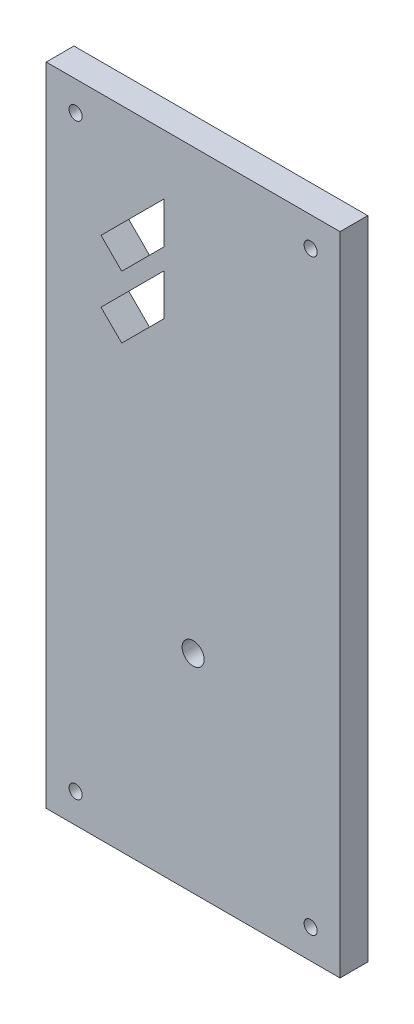
ISO-10303-21;
HEADER;
FILE_DESCRIPTION(('STEP AP214'),'2;1');
FILE_NAME('part.step','',(''),(''),'','','');
FILE_SCHEMA(('AUTOMOTIVE_DESIGN { 1 0 10303 214 1 1 1 1 }'));
ENDSEC;
DATA;
#1=APPLICATION_CONTEXT('core data for automotive mechanical design processes');
#2=APPLICATION_PROTOCOL_DEFINITION('international standard','automotive_design',2000,#1);
#3=PRODUCT_CONTEXT('',#1,'mechanical');
#4=PRODUCT('Part','Part','',(#3));
#5=PRODUCT_RELATED_PRODUCT_CATEGORY('part','',(#4));
#6=PRODUCT_DEFINITION_FORMATION('','',#4);
#7=PRODUCT_DEFINITION_CONTEXT('part definition',#1,'design');
#8=PRODUCT_DEFINITION('design','',#6,#7);
#9=PRODUCT_DEFINITION_SHAPE('','',#8);
#10=(LENGTH_UNIT() NAMED_UNIT(*) SI_UNIT(.MILLI.,.METRE.));
#11=(NAMED_UNIT(*) PLANE_ANGLE_UNIT() SI_UNIT($,.RADIAN.));
#12=(NAMED_UNIT(*) SI_UNIT($,.STERADIAN.) SOLID_ANGLE_UNIT());
#13=UNCERTAINTY_MEASURE_WITH_UNIT(LENGTH_MEASURE(1.E-05),#10,'distance_accuracy_value','');
#14=(GEOMETRIC_REPRESENTATION_CONTEXT(3) GLOBAL_UNCERTAINTY_ASSIGNED_CONTEXT((#13)) GLOBAL_UNIT_ASSIGNED_CONTEXT((#10,
#11,#12)) REPRESENTATION_CONTEXT('',''));
#15=CARTESIAN_POINT('',(0.,0.,0.));
#16=DIRECTION('',(0.,0.,1.));
#17=DIRECTION('',(1.,0.,0.));
#18=AXIS2_PLACEMENT_3D('',#15,#16,#17);
#19=CARTESIAN_POINT('',(0.,0.,5.9944));
#20=DIRECTION('',(0.,0.,-1.));
#21=DIRECTION('',(-1.,0.,0.));
#22=AXIS2_PLACEMENT_3D('',#19,#20,#21);
#23=PLANE('',#22);
#24=DIRECTION('',(0.707106781186544,0.707106781186551,0.));
#25=VECTOR('',#24,1.);
#26=CARTESIAN_POINT('',(16.320699121125,95.25,5.9944));
#27=LINE('',#26,#25);
#28=CARTESIAN_POINT('',(16.320699121125,95.25,5.9944));
#29=VERTEX_POINT('',#28);
#30=CARTESIAN_POINT('',(25.4818261492045,104.41112702808,5.9944));
#31=VERTEX_POINT('',#30);
#32=EDGE_CURVE('E158',#29,#31,#27,.T.);
#33=ORIENTED_EDGE('',*,*,#32,.F.);
#34=DIRECTION('',(0.707106781186552,-0.707106781186543,0.));
#35=VECTOR('',#34,1.);
#36=CARTESIAN_POINT('',(11.8417258962717,99.7289732248532,5.9944));
#37=LINE('',#36,#35);
#38=CARTESIAN_POINT('',(11.8417258962717,99.7289732248532,5.9944));
#39=VERTEX_POINT('',#38);
#40=EDGE_CURVE('E166',#39,#29,#37,.T.);
#41=ORIENTED_EDGE('',*,*,#40,.F.);
#42=DIRECTION('',(-0.707106781186544,-0.707106781186551,0.));
#43=VECTOR('',#42,1.);
#44=CARTESIAN_POINT('',(25.4818261492045,113.369073477786,5.9944));
#45=LINE('',#44,#43);
#46=CARTESIAN_POINT('',(25.4818261492045,113.369073477786,5.9944));
#47=VERTEX_POINT('',#46);
#48=EDGE_CURVE('E163',#47,#39,#45,.T.);
#49=ORIENTED_EDGE('',*,*,#48,.F.);
#50=DIRECTION('',(0.,1.,0.));
#51=VECTOR('',#50,1.);
#52=CARTESIAN_POINT('',(25.4818261492045,104.41112702808,5.9944));
#53=LINE('',#52,#51);
#54=EDGE_CURVE('E160',#31,#47,#53,.T.);
#55=ORIENTED_EDGE('',*,*,#54,.F.);
#56=EDGE_LOOP('',(#33,#41,#49,#55));
#57=FACE_BOUND('',#56,.T.);
#58=CARTESIAN_POINT('',(6.35,6.34999999999999,5.9944));
#59=DIRECTION('',(0.,0.,1.));
#60=DIRECTION('',(1.,0.,0.));
#61=AXIS2_PLACEMENT_3D('',#58,#59,#60);
#62=CIRCLE('',#61,1.4224);
#63=CARTESIAN_POINT('',(7.7724,6.34999999999999,5.9944));
#64=VERTEX_POINT('',#63);
#65=EDGE_CURVE('E195',#64,#64,#62,.T.);
#66=ORIENTED_EDGE('',*,*,#65,.F.);
#67=EDGE_LOOP('',(#66));
#68=FACE_BOUND('',#67,.T.);
#69=CARTESIAN_POINT('',(57.15,133.35,5.9944));
#70=DIRECTION('',(0.,0.,1.));
#71=DIRECTION('',(1.,0.,0.));
#72=AXIS2_PLACEMENT_3D('',#69,#70,#71);
#73=CIRCLE('',#72,1.4224);
#74=CARTESIAN_POINT('',(58.5724,133.35,5.9944));
#75=VERTEX_POINT('',#74);
#76=EDGE_CURVE('E207',#75,#75,#73,.T.);
#77=ORIENTED_EDGE('',*,*,#76,.F.);
#78=EDGE_LOOP('',(#77));
#79=FACE_BOUND('',#78,.T.);
#80=DIRECTION('',(0.,-1.,0.));
#81=VECTOR('',#80,1.);
#82=CARTESIAN_POINT('',(0.,0.,5.9944));
#83=LINE('',#82,#81);
#84=CARTESIAN_POINT('',(0.,139.7,5.9944));
#85=VERTEX_POINT('',#84);
#86=CARTESIAN_POINT('',(0.,0.,5.9944));
#87=VERTEX_POINT('',#86);
#88=EDGE_CURVE('E219',#85,#87,#83,.T.);
#89=ORIENTED_EDGE('',*,*,#88,.T.);
#90=DIRECTION('',(1.,0.,0.));
#91=VECTOR('',#90,1.);
#92=CARTESIAN_POINT('',(0.,0.,5.9944));
#93=LINE('',#92,#91);
#94=CARTESIAN_POINT('',(63.5,0.,5.9944));
#95=VERTEX_POINT('',#94);
#96=EDGE_CURVE('E222',#87,#95,#93,.T.);
#97=ORIENTED_EDGE('',*,*,#96,.T.);
#98=DIRECTION('',(0.,1.,0.));
#99=VECTOR('',#98,1.);
#100=CARTESIAN_POINT('',(63.5,0.,5.9944));
#101=LINE('',#100,#99);
#102=CARTESIAN_POINT('',(63.5,139.7,5.9944));
#103=VERTEX_POINT('',#102);
#104=EDGE_CURVE('E225',#95,#103,#101,.T.);
#105=ORIENTED_EDGE('',*,*,#104,.T.);
#106=DIRECTION('',(-1.,0.,0.));
#107=VECTOR('',#106,1.);
#108=CARTESIAN_POINT('',(0.,139.7,5.9944));
#109=LINE('',#108,#107);
#110=EDGE_CURVE('E227',#103,#85,#109,.T.);
#111=ORIENTED_EDGE('',*,*,#110,.T.);
#112=EDGE_LOOP('',(#89,#97,#105,#111));
#113=FACE_BOUND('',#112,.T.);
#114=CARTESIAN_POINT('',(6.35,133.35,5.9944));
#115=DIRECTION('',(0.,0.,1.));
#116=DIRECTION('',(1.,0.,0.));
#117=AXIS2_PLACEMENT_3D('',#114,#115,#116);
#118=CIRCLE('',#117,1.4224);
#119=CARTESIAN_POINT('',(7.7724,133.35,5.9944));
#120=VERTEX_POINT('',#119);
#121=EDGE_CURVE('E213',#120,#120,#118,.T.);
#122=ORIENTED_EDGE('',*,*,#121,.F.);
#123=EDGE_LOOP('',(#122));
#124=FACE_BOUND('',#123,.T.);
#125=CARTESIAN_POINT('',(57.15,6.34999999999999,5.9944));
#126=DIRECTION('',(0.,0.,1.));
#127=DIRECTION('',(1.,0.,0.));
#128=AXIS2_PLACEMENT_3D('',#125,#126,#127);
#129=CIRCLE('',#128,1.42239999999999);
#130=CARTESIAN_POINT('',(58.5724,6.34999999999999,5.9944));
#131=VERTEX_POINT('',#130);
#132=EDGE_CURVE('E201',#131,#131,#129,.T.);
#133=ORIENTED_EDGE('',*,*,#132,.F.);
#134=EDGE_LOOP('',(#133));
#135=FACE_BOUND('',#134,.T.);
#136=CARTESIAN_POINT('',(31.75,44.8945,5.9944));
#137=DIRECTION('',(0.,0.,1.));
#138=DIRECTION('',(1.,0.,0.));
#139=AXIS2_PLACEMENT_3D('',#136,#137,#138);
#140=CIRCLE('',#139,2.38124999999999);
#141=CARTESIAN_POINT('',(34.13125,44.8945,5.9944));
#142=VERTEX_POINT('',#141);
#143=EDGE_CURVE('E189',#142,#142,#140,.T.);
#144=ORIENTED_EDGE('',*,*,#143,.F.);
#145=EDGE_LOOP('',(#144));
#146=FACE_BOUND('',#145,.T.);
#147=DIRECTION('',(0.707106781186543,0.707106781186552,0.));
#148=VECTOR('',#147,1.);
#149=CARTESIAN_POINT('',(16.320699121125,108.698074510241,5.9944));
#150=LINE('',#149,#148);
#151=CARTESIAN_POINT('',(16.320699121125,108.698074510241,5.9944));
#152=VERTEX_POINT('',#151);
#153=CARTESIAN_POINT('',(25.4818261492045,117.859201538321,5.9944));
#154=VERTEX_POINT('',#153);
#155=EDGE_CURVE('E122',#152,#154,#150,.T.);
#156=ORIENTED_EDGE('',*,*,#155,.F.);
#157=DIRECTION('',(0.707106781186552,-0.707106781186543,0.));
#158=VECTOR('',#157,1.);
#159=CARTESIAN_POINT('',(11.8417258962718,113.177047735094,5.9944));
#160=LINE('',#159,#158);
#161=CARTESIAN_POINT('',(11.8417258962718,113.177047735094,5.9944));
#162=VERTEX_POINT('',#161);
#163=EDGE_CURVE('E144',#162,#152,#160,.T.);
#164=ORIENTED_EDGE('',*,*,#163,.F.);
#165=DIRECTION('',(-0.707106781186543,-0.707106781186552,0.));
#166=VECTOR('',#165,1.);
#167=CARTESIAN_POINT('',(25.4818261492045,126.817147988027,5.9944));
#168=LINE('',#167,#166);
#169=CARTESIAN_POINT('',(25.4818261492045,126.817147988027,5.9944));
#170=VERTEX_POINT('',#169);
#171=EDGE_CURVE('E142',#170,#162,#168,.T.);
#172=ORIENTED_EDGE('',*,*,#171,.F.);
#173=DIRECTION('',(0.,1.,0.));
#174=VECTOR('',#173,1.);
#175=CARTESIAN_POINT('',(25.4818261492045,117.859201538321,5.9944));
#176=LINE('',#175,#174);
#177=EDGE_CURVE('E130',#154,#170,#176,.T.);
#178=ORIENTED_EDGE('',*,*,#177,.F.);
#179=EDGE_LOOP('',(#156,#164,#172,#178));
#180=FACE_BOUND('',#179,.T.);
#181=ADVANCED_FACE('F33',(#57,#68,#79,#113,#124,#135,#146,#180),#23,.F.);
#182=CARTESIAN_POINT('',(0.,0.,0.));
#183=DIRECTION('',(0.,0.,-1.));
#184=DIRECTION('',(-1.,0.,0.));
#185=AXIS2_PLACEMENT_3D('',#182,#183,#184);
#186=PLANE('',#185);
#187=DIRECTION('',(0.707106781186552,-0.707106781186543,0.));
#188=VECTOR('',#187,1.);
#189=CARTESIAN_POINT('',(11.8417258962717,99.7289732248532,0.));
#190=LINE('',#189,#188);
#191=CARTESIAN_POINT('',(11.8417258962717,99.7289732248532,0.));
#192=VERTEX_POINT('',#191);
#193=CARTESIAN_POINT('',(16.320699121125,95.25,0.));
#194=VERTEX_POINT('',#193);
#195=EDGE_CURVE('E161',#192,#194,#190,.T.);
#196=ORIENTED_EDGE('',*,*,#195,.T.);
#197=DIRECTION('',(0.707106781186544,0.707106781186551,0.));
#198=VECTOR('',#197,1.);
#199=CARTESIAN_POINT('',(16.320699121125,95.25,0.));
#200=LINE('',#199,#198);
#201=CARTESIAN_POINT('',(25.4818261492045,104.41112702808,0.));
#202=VERTEX_POINT('',#201);
#203=EDGE_CURVE('E138',#194,#202,#200,.T.);
#204=ORIENTED_EDGE('',*,*,#203,.T.);
#205=DIRECTION('',(0.,1.,0.));
#206=VECTOR('',#205,1.);
#207=CARTESIAN_POINT('',(25.4818261492045,104.41112702808,0.));
#208=LINE('',#207,#206);
#209=CARTESIAN_POINT('',(25.4818261492045,113.369073477786,0.));
#210=VERTEX_POINT('',#209);
#211=EDGE_CURVE('E171',#202,#210,#208,.T.);
#212=ORIENTED_EDGE('',*,*,#211,.T.);
#213=DIRECTION('',(-0.707106781186544,-0.707106781186551,0.));
#214=VECTOR('',#213,1.);
#215=CARTESIAN_POINT('',(25.4818261492045,113.369073477786,0.));
#216=LINE('',#215,#214);
#217=EDGE_CURVE('E174',#210,#192,#216,.T.);
#218=ORIENTED_EDGE('',*,*,#217,.T.);
#219=EDGE_LOOP('',(#196,#204,#212,#218));
#220=FACE_BOUND('',#219,.T.);
#221=CARTESIAN_POINT('',(6.35,6.34999999999999,0.));
#222=DIRECTION('',(0.,0.,1.));
#223=DIRECTION('',(1.,0.,0.));
#224=AXIS2_PLACEMENT_3D('',#221,#222,#223);
#225=CIRCLE('',#224,1.4224);
#226=CARTESIAN_POINT('',(7.7724,6.34999999999999,0.));
#227=VERTEX_POINT('',#226);
#228=EDGE_CURVE('E192',#227,#227,#225,.T.);
#229=ORIENTED_EDGE('',*,*,#228,.T.);
#230=EDGE_LOOP('',(#229));
#231=FACE_BOUND('',#230,.T.);
#232=CARTESIAN_POINT('',(57.15,133.35,0.));
#233=DIRECTION('',(0.,0.,1.));
#234=DIRECTION('',(1.,0.,0.));
#235=AXIS2_PLACEMENT_3D('',#232,#233,#234);
#236=CIRCLE('',#235,1.4224);
#237=CARTESIAN_POINT('',(58.5724,133.35,0.));
#238=VERTEX_POINT('',#237);
#239=EDGE_CURVE('E204',#238,#238,#236,.T.);
#240=ORIENTED_EDGE('',*,*,#239,.T.);
#241=EDGE_LOOP('',(#240));
#242=FACE_BOUND('',#241,.T.);
#243=DIRECTION('',(0.,-1.,0.));
#244=VECTOR('',#243,1.);
#245=CARTESIAN_POINT('',(0.,0.,0.));
#246=LINE('',#245,#244);
#247=CARTESIAN_POINT('',(0.,139.7,0.));
#248=VERTEX_POINT('',#247);
#249=CARTESIAN_POINT('',(0.,0.,0.));
#250=VERTEX_POINT('',#249);
#251=EDGE_CURVE('E216',#248,#250,#246,.T.);
#252=ORIENTED_EDGE('',*,*,#251,.F.);
#253=DIRECTION('',(-1.,0.,0.));
#254=VECTOR('',#253,1.);
#255=CARTESIAN_POINT('',(0.,139.7,0.));
#256=LINE('',#255,#254);
#257=CARTESIAN_POINT('',(63.5,139.7,0.));
#258=VERTEX_POINT('',#257);
#259=EDGE_CURVE('E223',#258,#248,#256,.T.);
#260=ORIENTED_EDGE('',*,*,#259,.F.);
#261=DIRECTION('',(0.,1.,0.));
#262=VECTOR('',#261,1.);
#263=CARTESIAN_POINT('',(63.5,0.,0.));
#264=LINE('',#263,#262);
#265=CARTESIAN_POINT('',(63.5,0.,0.));
#266=VERTEX_POINT('',#265);
#267=EDGE_CURVE('E234',#266,#258,#264,.T.);
#268=ORIENTED_EDGE('',*,*,#267,.F.);
#269=DIRECTION('',(1.,0.,0.));
#270=VECTOR('',#269,1.);
#271=CARTESIAN_POINT('',(0.,0.,0.));
#272=LINE('',#271,#270);
#273=EDGE_CURVE('E232',#250,#266,#272,.T.);
#274=ORIENTED_EDGE('',*,*,#273,.F.);
#275=EDGE_LOOP('',(#252,#260,#268,#274));
#276=FACE_BOUND('',#275,.T.);
#277=CARTESIAN_POINT('',(6.35,133.35,0.));
#278=DIRECTION('',(0.,0.,1.));
#279=DIRECTION('',(1.,0.,0.));
#280=AXIS2_PLACEMENT_3D('',#277,#278,#279);
#281=CIRCLE('',#280,1.4224);
#282=CARTESIAN_POINT('',(7.7724,133.35,0.));
#283=VERTEX_POINT('',#282);
#284=EDGE_CURVE('E210',#283,#283,#281,.T.);
#285=ORIENTED_EDGE('',*,*,#284,.T.);
#286=EDGE_LOOP('',(#285));
#287=FACE_BOUND('',#286,.T.);
#288=CARTESIAN_POINT('',(57.15,6.34999999999999,0.));
#289=DIRECTION('',(0.,0.,1.));
#290=DIRECTION('',(1.,0.,0.));
#291=AXIS2_PLACEMENT_3D('',#288,#289,#290);
#292=CIRCLE('',#291,1.42239999999999);
#293=CARTESIAN_POINT('',(58.5724,6.34999999999999,0.));
#294=VERTEX_POINT('',#293);
#295=EDGE_CURVE('E198',#294,#294,#292,.T.);
#296=ORIENTED_EDGE('',*,*,#295,.T.);
#297=EDGE_LOOP('',(#296));
#298=FACE_BOUND('',#297,.T.);
#299=CARTESIAN_POINT('',(31.75,44.8945,0.));
#300=DIRECTION('',(0.,0.,1.));
#301=DIRECTION('',(1.,0.,0.));
#302=AXIS2_PLACEMENT_3D('',#299,#300,#301);
#303=CIRCLE('',#302,2.38124999999999);
#304=CARTESIAN_POINT('',(34.13125,44.8945,0.));
#305=VERTEX_POINT('',#304);
#306=EDGE_CURVE('E188',#305,#305,#303,.T.);
#307=ORIENTED_EDGE('',*,*,#306,.T.);
#308=EDGE_LOOP('',(#307));
#309=FACE_BOUND('',#308,.T.);
#310=DIRECTION('',(0.707106781186552,-0.707106781186543,0.));
#311=VECTOR('',#310,1.);
#312=CARTESIAN_POINT('',(11.8417258962718,113.177047735094,0.));
#313=LINE('',#312,#311);
#314=CARTESIAN_POINT('',(11.8417258962718,113.177047735094,0.));
#315=VERTEX_POINT('',#314);
#316=CARTESIAN_POINT('',(16.320699121125,108.698074510241,0.));
#317=VERTEX_POINT('',#316);
#318=EDGE_CURVE('E131',#315,#317,#313,.T.);
#319=ORIENTED_EDGE('',*,*,#318,.T.);
#320=DIRECTION('',(0.707106781186543,0.707106781186552,0.));
#321=VECTOR('',#320,1.);
#322=CARTESIAN_POINT('',(16.320699121125,108.698074510241,0.));
#323=LINE('',#322,#321);
#324=CARTESIAN_POINT('',(25.4818261492045,117.859201538321,0.));
#325=VERTEX_POINT('',#324);
#326=EDGE_CURVE('E56',#317,#325,#323,.T.);
#327=ORIENTED_EDGE('',*,*,#326,.T.);
#328=DIRECTION('',(0.,1.,0.));
#329=VECTOR('',#328,1.);
#330=CARTESIAN_POINT('',(25.4818261492045,117.859201538321,0.));
#331=LINE('',#330,#329);
#332=CARTESIAN_POINT('',(25.4818261492045,126.817147988027,0.));
#333=VERTEX_POINT('',#332);
#334=EDGE_CURVE('E137',#325,#333,#331,.T.);
#335=ORIENTED_EDGE('',*,*,#334,.T.);
#336=DIRECTION('',(-0.707106781186543,-0.707106781186552,0.));
#337=VECTOR('',#336,1.);
#338=CARTESIAN_POINT('',(25.4818261492045,126.817147988027,0.));
#339=LINE('',#338,#337);
#340=EDGE_CURVE('E150',#333,#315,#339,.T.);
#341=ORIENTED_EDGE('',*,*,#340,.T.);
#342=EDGE_LOOP('',(#319,#327,#335,#341));
#343=FACE_BOUND('',#342,.T.);
#344=ADVANCED_FACE('F252',(#220,#231,#242,#276,#287,#298,#309,#343),#186,.T.);
#345=CARTESIAN_POINT('',(0.,0.,5.9944));
#346=DIRECTION('',(1.,0.,0.));
#347=DIRECTION('',(0.,0.,-1.));
#348=AXIS2_PLACEMENT_3D('',#345,#346,#347);
#349=PLANE('',#348);
#350=ORIENTED_EDGE('',*,*,#251,.T.);
#351=DIRECTION('',(0.,0.,-1.));
#352=VECTOR('',#351,1.);
#353=CARTESIAN_POINT('',(0.,0.,5.9944));
#354=LINE('',#353,#352);
#355=EDGE_CURVE('E11',#87,#250,#354,.T.);
#356=ORIENTED_EDGE('',*,*,#355,.F.);
#357=ORIENTED_EDGE('',*,*,#88,.F.);
#358=DIRECTION('',(0.,0.,-1.));
#359=VECTOR('',#358,1.);
#360=CARTESIAN_POINT('',(0.,139.7,5.9944));
#361=LINE('',#360,#359);
#362=EDGE_CURVE('E229',#85,#248,#361,.T.);
#363=ORIENTED_EDGE('',*,*,#362,.T.);
#364=EDGE_LOOP('',(#350,#356,#357,#363));
#365=FACE_BOUND('',#364,.T.);
#366=ADVANCED_FACE('F35',(#365),#349,.F.);
#367=CARTESIAN_POINT('',(0.,0.,5.9944));
#368=DIRECTION('',(0.,1.,0.));
#369=DIRECTION('',(0.,0.,1.));
#370=AXIS2_PLACEMENT_3D('',#367,#368,#369);
#371=PLANE('',#370);
#372=ORIENTED_EDGE('',*,*,#273,.T.);
#373=DIRECTION('',(0.,0.,-1.));
#374=VECTOR('',#373,1.);
#375=CARTESIAN_POINT('',(63.5,0.,5.9944));
#376=LINE('',#375,#374);
#377=EDGE_CURVE('E41',#95,#266,#376,.T.);
#378=ORIENTED_EDGE('',*,*,#377,.F.);
#379=ORIENTED_EDGE('',*,*,#96,.F.);
#380=ORIENTED_EDGE('',*,*,#355,.T.);
#381=EDGE_LOOP('',(#372,#378,#379,#380));
#382=FACE_BOUND('',#381,.T.);
#383=ADVANCED_FACE('F263',(#382),#371,.F.);
#384=CARTESIAN_POINT('',(63.5,0.,5.9944));
#385=DIRECTION('',(-1.,0.,0.));
#386=DIRECTION('',(0.,0.,1.));
#387=AXIS2_PLACEMENT_3D('',#384,#385,#386);
#388=PLANE('',#387);
#389=ORIENTED_EDGE('',*,*,#267,.T.);
#390=DIRECTION('',(0.,0.,-1.));
#391=VECTOR('',#390,1.);
#392=CARTESIAN_POINT('',(63.5,139.7,5.9944));
#393=LINE('',#392,#391);
#394=EDGE_CURVE('E239',#103,#258,#393,.T.);
#395=ORIENTED_EDGE('',*,*,#394,.F.);
#396=ORIENTED_EDGE('',*,*,#104,.F.);
#397=ORIENTED_EDGE('',*,*,#377,.T.);
#398=EDGE_LOOP('',(#389,#395,#396,#397));
#399=FACE_BOUND('',#398,.T.);
#400=ADVANCED_FACE('F246',(#399),#388,.F.);
#401=CARTESIAN_POINT('',(0.,139.7,5.9944));
#402=DIRECTION('',(0.,-1.,0.));
#403=DIRECTION('',(0.,0.,-1.));
#404=AXIS2_PLACEMENT_3D('',#401,#402,#403);
#405=PLANE('',#404);
#406=ORIENTED_EDGE('',*,*,#259,.T.);
#407=ORIENTED_EDGE('',*,*,#362,.F.);
#408=ORIENTED_EDGE('',*,*,#110,.F.);
#409=ORIENTED_EDGE('',*,*,#394,.T.);
#410=EDGE_LOOP('',(#406,#407,#408,#409));
#411=FACE_BOUND('',#410,.T.);
#412=ADVANCED_FACE('F256',(#411),#405,.F.);
#413=CARTESIAN_POINT('',(6.35,133.35,5.9944));
#414=DIRECTION('',(0.,0.,-1.));
#415=DIRECTION('',(-1.,0.,0.));
#416=AXIS2_PLACEMENT_3D('',#413,#414,#415);
#417=CYLINDRICAL_SURFACE('',#416,1.4224);
#418=ORIENTED_EDGE('',*,*,#121,.T.);
#419=EDGE_LOOP('',(#418));
#420=FACE_BOUND('',#419,.T.);
#421=ORIENTED_EDGE('',*,*,#284,.F.);
#422=EDGE_LOOP('',(#421));
#423=FACE_BOUND('',#422,.T.);
#424=ADVANCED_FACE('F281',(#420,#423),#417,.F.);
#425=CARTESIAN_POINT('',(57.15,133.35,5.9944));
#426=DIRECTION('',(0.,0.,-1.));
#427=DIRECTION('',(-1.,0.,0.));
#428=AXIS2_PLACEMENT_3D('',#425,#426,#427);
#429=CYLINDRICAL_SURFACE('',#428,1.4224);
#430=ORIENTED_EDGE('',*,*,#76,.T.);
#431=EDGE_LOOP('',(#430));
#432=FACE_BOUND('',#431,.T.);
#433=ORIENTED_EDGE('',*,*,#239,.F.);
#434=EDGE_LOOP('',(#433));
#435=FACE_BOUND('',#434,.T.);
#436=ADVANCED_FACE('F288',(#432,#435),#429,.F.);
#437=CARTESIAN_POINT('',(57.15,6.34999999999999,5.9944));
#438=DIRECTION('',(0.,0.,-1.));
#439=DIRECTION('',(-1.,0.,0.));
#440=AXIS2_PLACEMENT_3D('',#437,#438,#439);
#441=CYLINDRICAL_SURFACE('',#440,1.42239999999999);
#442=ORIENTED_EDGE('',*,*,#132,.T.);
#443=EDGE_LOOP('',(#442));
#444=FACE_BOUND('',#443,.T.);
#445=ORIENTED_EDGE('',*,*,#295,.F.);
#446=EDGE_LOOP('',(#445));
#447=FACE_BOUND('',#446,.T.);
#448=ADVANCED_FACE('F293',(#444,#447),#441,.F.);
#449=CARTESIAN_POINT('',(6.35,6.34999999999999,5.9944));
#450=DIRECTION('',(0.,0.,-1.));
#451=DIRECTION('',(-1.,0.,0.));
#452=AXIS2_PLACEMENT_3D('',#449,#450,#451);
#453=CYLINDRICAL_SURFACE('',#452,1.4224);
#454=ORIENTED_EDGE('',*,*,#65,.T.);
#455=EDGE_LOOP('',(#454));
#456=FACE_BOUND('',#455,.T.);
#457=ORIENTED_EDGE('',*,*,#228,.F.);
#458=EDGE_LOOP('',(#457));
#459=FACE_BOUND('',#458,.T.);
#460=ADVANCED_FACE('F337',(#456,#459),#453,.F.);
#461=CARTESIAN_POINT('',(31.75,44.8945,5.9944));
#462=DIRECTION('',(0.,0.,-1.));
#463=DIRECTION('',(-1.,0.,0.));
#464=AXIS2_PLACEMENT_3D('',#461,#462,#463);
#465=CYLINDRICAL_SURFACE('',#464,2.38124999999999);
#466=ORIENTED_EDGE('',*,*,#143,.T.);
#467=EDGE_LOOP('',(#466));
#468=FACE_BOUND('',#467,.T.);
#469=ORIENTED_EDGE('',*,*,#306,.F.);
#470=EDGE_LOOP('',(#469));
#471=FACE_BOUND('',#470,.T.);
#472=ADVANCED_FACE('F333',(#468,#471),#465,.F.);
#473=CARTESIAN_POINT('',(16.320699121125,95.25,5.9944));
#474=DIRECTION('',(-0.707106781186551,0.707106781186544,0.));
#475=DIRECTION('',(-0.707106781186544,-0.707106781186551,0.));
#476=AXIS2_PLACEMENT_3D('',#473,#474,#475);
#477=PLANE('',#476);
#478=ORIENTED_EDGE('',*,*,#203,.F.);
#479=DIRECTION('',(0.,0.,-1.));
#480=VECTOR('',#479,1.);
#481=CARTESIAN_POINT('',(16.320699121125,95.25,5.9944));
#482=LINE('',#481,#480);
#483=EDGE_CURVE('E168',#29,#194,#482,.T.);
#484=ORIENTED_EDGE('',*,*,#483,.F.);
#485=ORIENTED_EDGE('',*,*,#32,.T.);
#486=DIRECTION('',(0.,0.,-1.));
#487=VECTOR('',#486,1.);
#488=CARTESIAN_POINT('',(25.4818261492045,104.41112702808,5.9944));
#489=LINE('',#488,#487);
#490=EDGE_CURVE('E185',#31,#202,#489,.T.);
#491=ORIENTED_EDGE('',*,*,#490,.T.);
#492=EDGE_LOOP('',(#478,#484,#485,#491));
#493=FACE_BOUND('',#492,.T.);
#494=ADVANCED_FACE('F329',(#493),#477,.T.);
#495=CARTESIAN_POINT('',(25.4818261492045,104.41112702808,5.9944));
#496=DIRECTION('',(-1.,0.,0.));
#497=DIRECTION('',(0.,-1.,0.));
#498=AXIS2_PLACEMENT_3D('',#495,#496,#497);
#499=PLANE('',#498);
#500=ORIENTED_EDGE('',*,*,#211,.F.);
#501=ORIENTED_EDGE('',*,*,#490,.F.);
#502=ORIENTED_EDGE('',*,*,#54,.T.);
#503=DIRECTION('',(0.,0.,-1.));
#504=VECTOR('',#503,1.);
#505=CARTESIAN_POINT('',(25.4818261492045,113.369073477786,5.9944));
#506=LINE('',#505,#504);
#507=EDGE_CURVE('E183',#47,#210,#506,.T.);
#508=ORIENTED_EDGE('',*,*,#507,.T.);
#509=EDGE_LOOP('',(#500,#501,#502,#508));
#510=FACE_BOUND('',#509,.T.);
#511=ADVANCED_FACE('F325',(#510),#499,.T.);
#512=CARTESIAN_POINT('',(25.4818261492045,113.369073477786,5.9944));
#513=DIRECTION('',(0.707106781186551,-0.707106781186544,0.));
#514=DIRECTION('',(0.707106781186544,0.707106781186551,0.));
#515=AXIS2_PLACEMENT_3D('',#512,#513,#514);
#516=PLANE('',#515);
#517=ORIENTED_EDGE('',*,*,#217,.F.);
#518=ORIENTED_EDGE('',*,*,#507,.F.);
#519=ORIENTED_EDGE('',*,*,#48,.T.);
#520=DIRECTION('',(0.,0.,-1.));
#521=VECTOR('',#520,1.);
#522=CARTESIAN_POINT('',(11.8417258962717,99.7289732248532,5.9944));
#523=LINE('',#522,#521);
#524=EDGE_CURVE('E181',#39,#192,#523,.T.);
#525=ORIENTED_EDGE('',*,*,#524,.T.);
#526=EDGE_LOOP('',(#517,#518,#519,#525));
#527=FACE_BOUND('',#526,.T.);
#528=ADVANCED_FACE('F321',(#527),#516,.T.);
#529=CARTESIAN_POINT('',(11.8417258962717,99.7289732248532,5.9944));
#530=DIRECTION('',(0.707106781186543,0.707106781186552,0.));
#531=DIRECTION('',(-0.707106781186552,0.707106781186543,0.));
#532=AXIS2_PLACEMENT_3D('',#529,#530,#531);
#533=PLANE('',#532);
#534=ORIENTED_EDGE('',*,*,#195,.F.);
#535=ORIENTED_EDGE('',*,*,#524,.F.);
#536=ORIENTED_EDGE('',*,*,#40,.T.);
#537=ORIENTED_EDGE('',*,*,#483,.T.);
#538=EDGE_LOOP('',(#534,#535,#536,#537));
#539=FACE_BOUND('',#538,.T.);
#540=ADVANCED_FACE('F318',(#539),#533,.T.);
#541=CARTESIAN_POINT('',(16.320699121125,108.698074510241,5.9944));
#542=DIRECTION('',(-0.707106781186552,0.707106781186543,0.));
#543=DIRECTION('',(-0.707106781186543,-0.707106781186552,0.));
#544=AXIS2_PLACEMENT_3D('',#541,#542,#543);
#545=PLANE('',#544);
#546=ORIENTED_EDGE('',*,*,#326,.F.);
#547=DIRECTION('',(0.,0.,-1.));
#548=VECTOR('',#547,1.);
#549=CARTESIAN_POINT('',(16.320699121125,108.698074510241,5.9944));
#550=LINE('',#549,#548);
#551=EDGE_CURVE('E126',#152,#317,#550,.T.);
#552=ORIENTED_EDGE('',*,*,#551,.F.);
#553=ORIENTED_EDGE('',*,*,#155,.T.);
#554=DIRECTION('',(0.,0.,-1.));
#555=VECTOR('',#554,1.);
#556=CARTESIAN_POINT('',(25.4818261492045,117.859201538321,5.9944));
#557=LINE('',#556,#555);
#558=EDGE_CURVE('E125',#154,#325,#557,.T.);
#559=ORIENTED_EDGE('',*,*,#558,.T.);
#560=EDGE_LOOP('',(#546,#552,#553,#559));
#561=FACE_BOUND('',#560,.T.);
#562=ADVANCED_FACE('F124',(#561),#545,.T.);
#563=CARTESIAN_POINT('',(25.4818261492045,117.859201538321,5.9944));
#564=DIRECTION('',(-1.,0.,0.));
#565=DIRECTION('',(0.,-1.,0.));
#566=AXIS2_PLACEMENT_3D('',#563,#564,#565);
#567=PLANE('',#566);
#568=ORIENTED_EDGE('',*,*,#334,.F.);
#569=ORIENTED_EDGE('',*,*,#558,.F.);
#570=ORIENTED_EDGE('',*,*,#177,.T.);
#571=DIRECTION('',(0.,0.,-1.));
#572=VECTOR('',#571,1.);
#573=CARTESIAN_POINT('',(25.4818261492045,126.817147988027,5.9944));
#574=LINE('',#573,#572);
#575=EDGE_CURVE('E139',#170,#333,#574,.T.);
#576=ORIENTED_EDGE('',*,*,#575,.T.);
#577=EDGE_LOOP('',(#568,#569,#570,#576));
#578=FACE_BOUND('',#577,.T.);
#579=ADVANCED_FACE('F134',(#578),#567,.T.);
#580=CARTESIAN_POINT('',(25.4818261492045,126.817147988027,5.9944));
#581=DIRECTION('',(0.707106781186552,-0.707106781186543,0.));
#582=DIRECTION('',(0.707106781186543,0.707106781186552,0.));
#583=AXIS2_PLACEMENT_3D('',#580,#581,#582);
#584=PLANE('',#583);
#585=ORIENTED_EDGE('',*,*,#340,.F.);
#586=ORIENTED_EDGE('',*,*,#575,.F.);
#587=ORIENTED_EDGE('',*,*,#171,.T.);
#588=DIRECTION('',(0.,0.,-1.));
#589=VECTOR('',#588,1.);
#590=CARTESIAN_POINT('',(11.8417258962718,113.177047735094,5.9944));
#591=LINE('',#590,#589);
#592=EDGE_CURVE('E48',#162,#315,#591,.T.);
#593=ORIENTED_EDGE('',*,*,#592,.T.);
#594=EDGE_LOOP('',(#585,#586,#587,#593));
#595=FACE_BOUND('',#594,.T.);
#596=ADVANCED_FACE('F306',(#595),#584,.T.);
#597=CARTESIAN_POINT('',(11.8417258962718,113.177047735094,5.9944));
#598=DIRECTION('',(0.707106781186543,0.707106781186552,0.));
#599=DIRECTION('',(-0.707106781186552,0.707106781186543,0.));
#600=AXIS2_PLACEMENT_3D('',#597,#598,#599);
#601=PLANE('',#600);
#602=ORIENTED_EDGE('',*,*,#318,.F.);
#603=ORIENTED_EDGE('',*,*,#592,.F.);
#604=ORIENTED_EDGE('',*,*,#163,.T.);
#605=ORIENTED_EDGE('',*,*,#551,.T.);
#606=EDGE_LOOP('',(#602,#603,#604,#605));
#607=FACE_BOUND('',#606,.T.);
#608=ADVANCED_FACE('F304',(#607),#601,.T.);
#609=CLOSED_SHELL('',(#181,#344,#366,#383,#400,#412,#424,#436,#448,#460,#472,#494,#511,#528,
#540,#562,#579,#596,#608));
#610=MANIFOLD_SOLID_BREP('B2',#609);
#611=ADVANCED_BREP_SHAPE_REPRESENTATION('',(#18,#610),#14);
#612=SHAPE_DEFINITION_REPRESENTATION(#9,#611);
ENDSEC;
END-ISO-10303-21;
